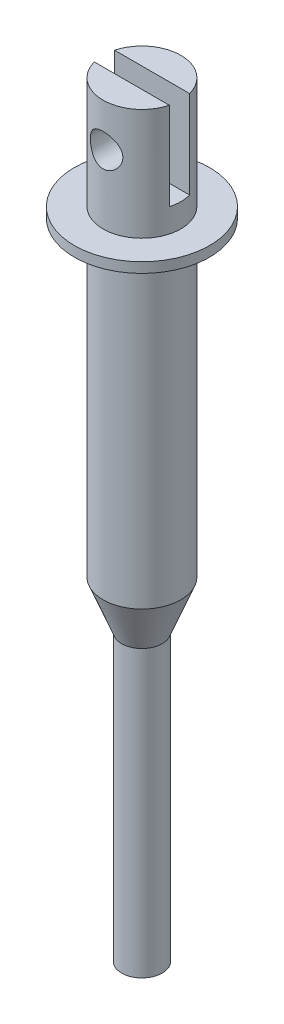
ISO-10303-21;
HEADER;
FILE_DESCRIPTION(('STEP AP214'),'2;1');
FILE_NAME('part.step','',(''),(''),'','','');
FILE_SCHEMA(('AUTOMOTIVE_DESIGN { 1 0 10303 214 1 1 1 1 }'));
ENDSEC;
DATA;
#1=APPLICATION_CONTEXT('core data for automotive mechanical design processes');
#2=APPLICATION_PROTOCOL_DEFINITION('international standard','automotive_design',2000,#1);
#3=PRODUCT_CONTEXT('',#1,'mechanical');
#4=PRODUCT('Part','Part','',(#3));
#5=PRODUCT_RELATED_PRODUCT_CATEGORY('part','',(#4));
#6=PRODUCT_DEFINITION_FORMATION('','',#4);
#7=PRODUCT_DEFINITION_CONTEXT('part definition',#1,'design');
#8=PRODUCT_DEFINITION('design','',#6,#7);
#9=PRODUCT_DEFINITION_SHAPE('','',#8);
#10=(LENGTH_UNIT() NAMED_UNIT(*) SI_UNIT(.MILLI.,.METRE.));
#11=(NAMED_UNIT(*) PLANE_ANGLE_UNIT() SI_UNIT($,.RADIAN.));
#12=(NAMED_UNIT(*) SI_UNIT($,.STERADIAN.) SOLID_ANGLE_UNIT());
#13=UNCERTAINTY_MEASURE_WITH_UNIT(LENGTH_MEASURE(1.E-05),#10,'distance_accuracy_value','');
#14=(GEOMETRIC_REPRESENTATION_CONTEXT(3) GLOBAL_UNCERTAINTY_ASSIGNED_CONTEXT((#13)) GLOBAL_UNIT_ASSIGNED_CONTEXT((#10,
#11,#12)) REPRESENTATION_CONTEXT('',''));
#15=CARTESIAN_POINT('',(0.,0.,0.));
#16=DIRECTION('',(0.,0.,1.));
#17=DIRECTION('',(1.,0.,0.));
#18=AXIS2_PLACEMENT_3D('',#15,#16,#17);
#19=CARTESIAN_POINT('',(0.,56.6,0.));
#20=DIRECTION('',(0.,1.,0.));
#21=DIRECTION('',(-1.,0.,0.));
#22=AXIS2_PLACEMENT_3D('',#19,#20,#21);
#23=CYLINDRICAL_SURFACE('',#22,2.875);
#24=CARTESIAN_POINT('',(0.,24.6,0.));
#25=DIRECTION('',(0.,1.,0.));
#26=DIRECTION('',(-1.,0.,0.));
#27=AXIS2_PLACEMENT_3D('',#24,#25,#26);
#28=CIRCLE('',#27,2.875);
#29=CARTESIAN_POINT('',(-2.875,24.6,0.));
#30=VERTEX_POINT('',#29);
#31=EDGE_CURVE('E107',#30,#30,#28,.T.);
#32=ORIENTED_EDGE('',*,*,#31,.T.);
#33=EDGE_LOOP('',(#32));
#34=FACE_BOUND('',#33,.T.);
#35=CARTESIAN_POINT('',(0.,47.6,0.));
#36=DIRECTION('',(0.,1.,0.));
#37=DIRECTION('',(-1.,0.,0.));
#38=AXIS2_PLACEMENT_3D('',#35,#36,#37);
#39=CIRCLE('',#38,2.875);
#40=CARTESIAN_POINT('',(-2.875,47.6,0.));
#41=VERTEX_POINT('',#40);
#42=EDGE_CURVE('E11',#41,#41,#39,.T.);
#43=ORIENTED_EDGE('',*,*,#42,.F.);
#44=EDGE_LOOP('',(#43));
#45=FACE_BOUND('',#44,.T.);
#46=ADVANCED_FACE('F44',(#34,#45),#23,.T.);
#47=CARTESIAN_POINT('',(0.,0.,0.));
#48=DIRECTION('',(0.,1.,0.));
#49=DIRECTION('',(-1.,0.,0.));
#50=AXIS2_PLACEMENT_3D('',#47,#48,#49);
#51=PLANE('',#50);
#52=CARTESIAN_POINT('',(0.,0.,0.));
#53=DIRECTION('',(0.,1.,0.));
#54=DIRECTION('',(-1.,0.,0.));
#55=AXIS2_PLACEMENT_3D('',#52,#53,#54);
#56=CIRCLE('',#55,1.50000000000001);
#57=CARTESIAN_POINT('',(-1.50000000000001,0.,0.));
#58=VERTEX_POINT('',#57);
#59=EDGE_CURVE('E125',#58,#58,#56,.T.);
#60=ORIENTED_EDGE('',*,*,#59,.F.);
#61=EDGE_LOOP('',(#60));
#62=FACE_BOUND('',#61,.T.);
#63=ADVANCED_FACE('F46',(#62),#51,.F.);
#64=CARTESIAN_POINT('',(0.,56.6,0.));
#65=DIRECTION('',(0.,1.,0.));
#66=DIRECTION('',(-1.,0.,0.));
#67=AXIS2_PLACEMENT_3D('',#64,#65,#66);
#68=CYLINDRICAL_SURFACE('',#67,1.50000000000001);
#69=CARTESIAN_POINT('',(0.,21.1,0.));
#70=DIRECTION('',(0.,1.,0.));
#71=DIRECTION('',(-1.,0.,0.));
#72=AXIS2_PLACEMENT_3D('',#69,#70,#71);
#73=CIRCLE('',#72,1.50000000000001);
#74=CARTESIAN_POINT('',(-1.50000000000001,21.1,0.));
#75=VERTEX_POINT('',#74);
#76=EDGE_CURVE('E115',#75,#75,#73,.T.);
#77=ORIENTED_EDGE('',*,*,#76,.F.);
#78=EDGE_LOOP('',(#77));
#79=FACE_BOUND('',#78,.T.);
#80=ORIENTED_EDGE('',*,*,#59,.T.);
#81=EDGE_LOOP('',(#80));
#82=FACE_BOUND('',#81,.T.);
#83=ADVANCED_FACE('F172',(#79,#82),#68,.T.);
#84=CARTESIAN_POINT('',(0.,21.1,0.));
#85=DIRECTION('',(0.,1.,0.));
#86=DIRECTION('',(-1.,0.,0.));
#87=AXIS2_PLACEMENT_3D('',#84,#85,#86);
#88=CONICAL_SURFACE('',#87,1.50000000000001,0.374333616007583);
#89=ORIENTED_EDGE('',*,*,#31,.F.);
#90=EDGE_LOOP('',(#89));
#91=FACE_BOUND('',#90,.T.);
#92=ORIENTED_EDGE('',*,*,#76,.T.);
#93=EDGE_LOOP('',(#92));
#94=FACE_BOUND('',#93,.T.);
#95=ADVANCED_FACE('F284',(#91,#94),#88,.T.);
#96=CARTESIAN_POINT('',(0.,48.35,0.));
#97=DIRECTION('',(0.,-1.,0.));
#98=DIRECTION('',(1.,0.,0.));
#99=AXIS2_PLACEMENT_3D('',#96,#97,#98);
#100=CYLINDRICAL_SURFACE('',#99,5.);
#101=CARTESIAN_POINT('',(0.,48.35,0.));
#102=DIRECTION('',(0.,1.,0.));
#103=DIRECTION('',(-1.,0.,0.));
#104=AXIS2_PLACEMENT_3D('',#101,#102,#103);
#105=CIRCLE('',#104,5.);
#106=CARTESIAN_POINT('',(-5.,48.35,0.));
#107=VERTEX_POINT('',#106);
#108=EDGE_CURVE('E183',#107,#107,#105,.T.);
#109=ORIENTED_EDGE('',*,*,#108,.F.);
#110=EDGE_LOOP('',(#109));
#111=FACE_BOUND('',#110,.T.);
#112=CARTESIAN_POINT('',(0.,47.6,0.));
#113=DIRECTION('',(0.,1.,0.));
#114=DIRECTION('',(-1.,0.,0.));
#115=AXIS2_PLACEMENT_3D('',#112,#113,#114);
#116=CIRCLE('',#115,5.);
#117=CARTESIAN_POINT('',(-5.,47.6,0.));
#118=VERTEX_POINT('',#117);
#119=EDGE_CURVE('E188',#118,#118,#116,.T.);
#120=ORIENTED_EDGE('',*,*,#119,.T.);
#121=EDGE_LOOP('',(#120));
#122=FACE_BOUND('',#121,.T.);
#123=ADVANCED_FACE('F280',(#111,#122),#100,.T.);
#124=CARTESIAN_POINT('',(0.,48.35,0.));
#125=DIRECTION('',(0.,1.,0.));
#126=DIRECTION('',(-1.,0.,0.));
#127=AXIS2_PLACEMENT_3D('',#124,#125,#126);
#128=PLANE('',#127);
#129=CARTESIAN_POINT('',(0.,48.35,0.));
#130=DIRECTION('',(0.,1.,0.));
#131=DIRECTION('',(-1.,0.,0.));
#132=AXIS2_PLACEMENT_3D('',#129,#130,#131);
#133=CIRCLE('',#132,2.875);
#134=CARTESIAN_POINT('',(-2.875,48.35,0.));
#135=VERTEX_POINT('',#134);
#136=EDGE_CURVE('E48',#135,#135,#133,.T.);
#137=ORIENTED_EDGE('',*,*,#136,.F.);
#138=EDGE_LOOP('',(#137));
#139=FACE_BOUND('',#138,.T.);
#140=ORIENTED_EDGE('',*,*,#108,.T.);
#141=EDGE_LOOP('',(#140));
#142=FACE_BOUND('',#141,.T.);
#143=ADVANCED_FACE('F283',(#139,#142),#128,.T.);
#144=CARTESIAN_POINT('',(0.,47.6,0.));
#145=DIRECTION('',(0.,1.,0.));
#146=DIRECTION('',(-1.,0.,0.));
#147=AXIS2_PLACEMENT_3D('',#144,#145,#146);
#148=PLANE('',#147);
#149=ORIENTED_EDGE('',*,*,#42,.T.);
#150=EDGE_LOOP('',(#149));
#151=FACE_BOUND('',#150,.T.);
#152=ORIENTED_EDGE('',*,*,#119,.F.);
#153=EDGE_LOOP('',(#152));
#154=FACE_BOUND('',#153,.T.);
#155=ADVANCED_FACE('F151',(#151,#154),#148,.F.);
#156=CARTESIAN_POINT('',(0.,53.4,-2.875));
#157=DIRECTION('',(0.,0.,1.));
#158=DIRECTION('',(1.,0.,0.));
#159=AXIS2_PLACEMENT_3D('',#156,#157,#158);
#160=CYLINDRICAL_SURFACE('',#159,1.2);
#161=CARTESIAN_POINT('',(0.,53.4,0.75));
#162=DIRECTION('',(0.,0.,1.));
#163=DIRECTION('',(1.,0.,0.));
#164=AXIS2_PLACEMENT_3D('',#161,#162,#163);
#165=CIRCLE('',#164,1.2);
#166=CARTESIAN_POINT('',(1.2,53.4,0.75));
#167=VERTEX_POINT('',#166);
#168=EDGE_CURVE('E204',#167,#167,#165,.F.);
#169=ORIENTED_EDGE('',*,*,#168,.T.);
#170=EDGE_LOOP('',(#169));
#171=FACE_BOUND('',#170,.T.);
#172=CARTESIAN_POINT('',(1.2,53.4,2.61258971137835));
#173=CARTESIAN_POINT('',(1.19999284556273,53.3360063842677,2.61259664140036));
#174=CARTESIAN_POINT('',(1.19484858976294,53.2719087327679,2.61497523266794));
#175=CARTESIAN_POINT('',(1.1744704973721,53.1455639299689,2.62418758364091));
#176=CARTESIAN_POINT('',(1.15920930563969,53.0833222752231,2.6310334215288));
#177=CARTESIAN_POINT('',(1.11929601028592,52.9627456288845,2.64825758800242));
#178=CARTESIAN_POINT('',(1.09468227852068,52.9043958046387,2.65862146439826));
#179=CARTESIAN_POINT('',(1.03687520776025,52.7926705251039,2.68169338490034));
#180=CARTESIAN_POINT('',(1.00368387749264,52.7392939091506,2.69440087997175));
#181=CARTESIAN_POINT('',(0.927447774108694,52.6356646893032,2.72161565839842));
#182=CARTESIAN_POINT('',(0.883951439116221,52.5857601815999,2.73618411164575));
#183=CARTESIAN_POINT('',(0.789288182927321,52.493696541244,2.76497659915055));
#184=CARTESIAN_POINT('',(0.738118312042364,52.4515404009749,2.77920049850946));
#185=CARTESIAN_POINT('',(0.626824192142549,52.3743927247425,2.80644516352552));
#186=CARTESIAN_POINT('',(0.56640702115442,52.3397931793169,2.81938655143998));
#187=CARTESIAN_POINT('',(0.439971996401211,52.2813995143558,2.84185900778628));
#188=CARTESIAN_POINT('',(0.373956652633748,52.2576005823396,2.85139159469154));
#189=CARTESIAN_POINT('',(0.241854227766699,52.2227463459582,2.86553849488684));
#190=CARTESIAN_POINT('',(0.175950763836402,52.21109068543,2.87038356234547));
#191=CARTESIAN_POINT('',(0.0429573143125445,52.1989136541522,2.87544790566677));
#192=CARTESIAN_POINT('',(-0.024132177093845,52.1983877504841,2.87566906475079));
#193=CARTESIAN_POINT('',(-0.153226834231555,52.2081712297781,2.87159632181655));
#194=CARTESIAN_POINT('',(-0.215292295883481,52.2178208958016,2.86757731615899));
#195=CARTESIAN_POINT('',(-0.336829155461755,52.2465503016811,2.85585363944535));
#196=CARTESIAN_POINT('',(-0.396300361768366,52.2656307368437,2.84814869663584));
#197=CARTESIAN_POINT('',(-0.512052092155438,52.3129065084115,2.82964988292411));
#198=CARTESIAN_POINT('',(-0.568270068777885,52.3412365098751,2.81881066423381));
#199=CARTESIAN_POINT('',(-0.675301378303749,52.4060749949218,2.79510330548184));
#200=CARTESIAN_POINT('',(-0.726112789574458,52.4425863721511,2.78223444804145));
#201=CARTESIAN_POINT('',(-0.824705876688111,52.5257529634537,2.75468471207565));
#202=CARTESIAN_POINT('',(-0.87201937498326,52.5729428425615,2.73994004851096));
#203=CARTESIAN_POINT('',(-0.958263792466822,52.6746192268054,2.71098313312504));
#204=CARTESIAN_POINT('',(-0.99719145438691,52.7291085539491,2.69677108995104));
#205=CARTESIAN_POINT('',(-1.06676692248664,52.8461136984182,2.67003220002571));
#206=CARTESIAN_POINT('',(-1.09709825636768,52.9088353956019,2.65757664597254));
#207=CARTESIAN_POINT('',(-1.14657693911118,53.03915425907,2.63661088561045));
#208=CARTESIAN_POINT('',(-1.16573231727387,53.1067478858202,2.62809784773286));
#209=CARTESIAN_POINT('',(-1.19112252033481,53.2402001414986,2.61668393132893));
#210=CARTESIAN_POINT('',(-1.19811668182481,53.3058856699208,2.6134540433806));
#211=CARTESIAN_POINT('',(-1.20121682547205,53.4375570735708,2.6120314574288));
#212=CARTESIAN_POINT('',(-1.197326596406,53.5035428363059,2.61383700662579));
#213=CARTESIAN_POINT('',(-1.17946141197837,53.6294676105247,2.62194183799779));
#214=CARTESIAN_POINT('',(-1.1661514547335,53.6895225031113,2.62794450001455));
#215=CARTESIAN_POINT('',(-1.1307066527664,53.8064967746091,2.64338766907825));
#216=CARTESIAN_POINT('',(-1.10856974053102,53.8634154153673,2.65282898150583));
#217=CARTESIAN_POINT('',(-1.05505780609811,53.9752002853966,2.67457347812789));
#218=CARTESIAN_POINT('',(-1.02333072031862,54.0298770125232,2.6869810785552));
#219=CARTESIAN_POINT('',(-0.951888914716149,54.1333938322438,2.7131121976691));
#220=CARTESIAN_POINT('',(-0.9121707292119,54.1822313777259,2.72683628595091));
#221=CARTESIAN_POINT('',(-0.822047356686276,54.2768387420158,2.75540784963529));
#222=CARTESIAN_POINT('',(-0.771033960416184,54.3220314267248,2.77025544673861));
#223=CARTESIAN_POINT('',(-0.661804109583874,54.4033192075952,2.79835973701495));
#224=CARTESIAN_POINT('',(-0.603587116520102,54.4394136230063,2.8116163111057));
#225=CARTESIAN_POINT('',(-0.481181519150637,54.501445322625,2.83513293140083));
#226=CARTESIAN_POINT('',(-0.416977247408784,54.5273549771092,2.84538480742831));
#227=CARTESIAN_POINT('',(-0.284583345105468,54.5678166380713,2.86165582229945));
#228=CARTESIAN_POINT('',(-0.216396121833665,54.5823754301837,2.86767748978151));
#229=CARTESIAN_POINT('',(-0.0831297585472931,54.5988653584502,2.87451783188243));
#230=CARTESIAN_POINT('',(-0.0181678182559825,54.6016101572468,2.87567164824115));
#231=CARTESIAN_POINT('',(0.111268134308395,54.5965833987115,2.87357459210295));
#232=CARTESIAN_POINT('',(0.175742230627629,54.5888136963134,2.87032449652962));
#233=CARTESIAN_POINT('',(0.299999994009444,54.56356263346,2.85996118715932));
#234=CARTESIAN_POINT('',(0.359868936928414,54.5464377788464,2.85298998790774));
#235=CARTESIAN_POINT('',(0.475860921809012,54.5033523456,2.8359515309254));
#236=CARTESIAN_POINT('',(0.531983251066755,54.4773900915591,2.82588368616258));
#237=CARTESIAN_POINT('',(0.641685358056028,54.4160543897767,2.80306011332294));
#238=CARTESIAN_POINT('',(0.695035352481653,54.3803084127209,2.79020341530483));
#239=CARTESIAN_POINT('',(0.795207511053898,54.3009614270475,2.76332485161005));
#240=CARTESIAN_POINT('',(0.842027230026578,54.2573574900547,2.74930255260948));
#241=CARTESIAN_POINT('',(0.931136804507447,54.1600194602667,2.72046883469035));
#242=CARTESIAN_POINT('',(0.972898597584325,54.1057967846109,2.70566895857699));
#243=CARTESIAN_POINT('',(1.04680854725829,53.990653386878,2.67794349687549));
#244=CARTESIAN_POINT('',(1.07895131830978,53.9297289385858,2.66501896334157));
#245=CARTESIAN_POINT('',(1.13236916052694,53.8030421214063,2.64276416292639));
#246=CARTESIAN_POINT('',(1.15369986094035,53.7373065500123,2.63341555982185));
#247=CARTESIAN_POINT('',(1.18473965962268,53.6027867622469,2.619602669705));
#248=CARTESIAN_POINT('',(1.19448773857349,53.5340135840481,2.61512200429952));
#249=CARTESIAN_POINT('',(1.19941551372524,53.4433379417888,2.61285709596707));
#250=CARTESIAN_POINT('',(1.20000242324153,53.4216749384315,2.61258736414732));
#251=CARTESIAN_POINT('',(1.2,53.4,2.61258971137835));
#252=B_SPLINE_CURVE_WITH_KNOTS('',3,(#172,#173,#174,#175,#176,#177,#178,#179,#180,#181,#182,
#183,#184,#185,#186,#187,#188,#189,#190,#191,#192,#193,#194,#195,#196,#197,#198,#199,#200,#201,
#202,#203,#204,#205,#206,#207,#208,#209,#210,#211,#212,#213,#214,#215,#216,#217,#218,#219,#220,
#221,#222,#223,#224,#225,#226,#227,#228,#229,#230,#231,#232,#233,#234,#235,#236,#237,#238,#239,
#240,#241,#242,#243,#244,#245,#246,#247,#248,#249,#250,#251),.UNSPECIFIED.,.T.,.F.,(4,2,2,2,2,2,
2,2,2,2,2,2,2,2,2,2,2,2,2,2,2,2,2,2,2,2,2,2,2,2,2,2,2,2,2,2,2,2,2,4),(0.,0.191918579757424,
0.384358215578368,0.576016684121689,0.767630310122134,0.970095159555179,1.1726380364294,
1.38400200285017,1.59527169813264,1.7955133813559,1.99567350873217,2.18361046358322,
2.37156127661591,2.56238054684033,2.75326741418508,2.95764988815247,3.16211160680424,
3.37333647948665,3.58440941142493,3.78175385792235,3.97902961880925,4.16361186152578,
4.34823736384848,4.54069511560212,4.73323651549177,4.94151753155633,5.14981412698926,
5.35867196302944,5.56740484627838,5.76150543591806,5.95557178743124,6.142711912663,
6.32988753599414,6.52552840728342,6.72124233813216,6.93032825768786,7.13953102322331,
7.34764620550038,7.5550589855349,7.62006271055499),.UNSPECIFIED.);
#253=CARTESIAN_POINT('',(1.2,53.4,2.61258971137835));
#254=VERTEX_POINT('',#253);
#255=EDGE_CURVE('E129',#254,#254,#252,.T.);
#256=ORIENTED_EDGE('',*,*,#255,.F.);
#257=EDGE_LOOP('',(#256));
#258=FACE_BOUND('',#257,.T.);
#259=ADVANCED_FACE('F146',(#171,#258),#160,.F.);
#260=CARTESIAN_POINT('',(0.,53.4,-0.75));
#261=DIRECTION('',(0.,0.,-1.));
#262=DIRECTION('',(-1.,0.,0.));
#263=AXIS2_PLACEMENT_3D('',#260,#261,#262);
#264=CIRCLE('',#263,1.2);
#265=CARTESIAN_POINT('',(-1.2,53.4,-0.749999999999999));
#266=VERTEX_POINT('',#265);
#267=EDGE_CURVE('E103',#266,#266,#264,.F.);
#268=ORIENTED_EDGE('',*,*,#267,.T.);
#269=EDGE_LOOP('',(#268));
#270=FACE_BOUND('',#269,.T.);
#271=CARTESIAN_POINT('',(0.,54.6,-2.875));
#272=CARTESIAN_POINT('',(-0.0642702003449837,54.5999930486833,-2.87499477092273));
#273=CARTESIAN_POINT('',(-0.128640977369331,54.5948060733855,-2.87281991288097));
#274=CARTESIAN_POINT('',(-0.255557692306066,54.5742425694996,-2.86433020707326));
#275=CARTESIAN_POINT('',(-0.318098433282713,54.5588395021803,-2.85800457714638));
#276=CARTESIAN_POINT('',(-0.4393108796073,54.5185122918236,-2.84189289412547));
#277=CARTESIAN_POINT('',(-0.497994926858027,54.4936204474956,-2.83211858823766));
#278=CARTESIAN_POINT('',(-0.61029729455332,54.4351558089209,-2.81006080886084));
#279=CARTESIAN_POINT('',(-0.663917132993702,54.4015856273522,-2.79777809078133));
#280=CARTESIAN_POINT('',(-0.767354059969789,54.3249322494784,-2.77124054984708));
#281=CARTESIAN_POINT('',(-0.816882728036641,54.2814824637055,-2.75692099708886));
#282=CARTESIAN_POINT('',(-0.908198300251296,54.1870784278661,-2.72820392861484));
#283=CARTESIAN_POINT('',(-0.949981115047008,54.1361202391416,-2.71380637582431));
#284=CARTESIAN_POINT('',(-1.02665922400105,54.0250936753486,-2.68576741561524));
#285=CARTESIAN_POINT('',(-1.06111215716524,53.9646995570416,-2.67219852712514));
#286=CARTESIAN_POINT('',(-1.11924147276094,53.8383248966416,-2.64838020475281));
#287=CARTESIAN_POINT('',(-1.14292342590447,53.7723472633133,-2.63812905574075));
#288=CARTESIAN_POINT('',(-1.17764647570023,53.6399981744278,-2.62280772401278));
#289=CARTESIAN_POINT('',(-1.1892427693492,53.5737995878203,-2.61751125954026));
#290=CARTESIAN_POINT('',(-1.20119733851004,53.440200638478,-2.61204857715627));
#291=CARTESIAN_POINT('',(-1.2015618426911,53.3728009625676,-2.61187951580754));
#292=CARTESIAN_POINT('',(-1.19146056016093,53.2442521205738,-2.61649930278983));
#293=CARTESIAN_POINT('',(-1.18182629600421,53.1830211826379,-2.62090750828224));
#294=CARTESIAN_POINT('',(-1.15339609374654,53.0631409430646,-2.63354169214506));
#295=CARTESIAN_POINT('',(-1.1345983939025,53.004492140228,-2.64176840463911));
#296=CARTESIAN_POINT('',(-1.08800820174634,52.8899573596158,-2.66129863494795));
#297=CARTESIAN_POINT('',(-1.06003252930545,52.8341569150549,-2.67266399605831));
#298=CARTESIAN_POINT('',(-0.996010083183636,52.7278250001926,-2.697176669546));
#299=CARTESIAN_POINT('',(-0.959960120320865,52.6772956234474,-2.71032468522386));
#300=CARTESIAN_POINT('',(-0.877222357676711,52.5784285435401,-2.73827812260127));
#301=CARTESIAN_POINT('',(-0.829891553278451,52.5306404166457,-2.75312952507089));
#302=CARTESIAN_POINT('',(-0.727740908499753,52.4434950992422,-2.78187554387864));
#303=CARTESIAN_POINT('',(-0.67291930665602,52.4041398973447,-2.79576993401573));
#304=CARTESIAN_POINT('',(-0.555668201541569,52.3341678256903,-2.82144239789839));
#305=CARTESIAN_POINT('',(-0.493091524597958,52.3037752383366,-2.83316379773823));
#306=CARTESIAN_POINT('',(-0.363099321817605,52.2541415246333,-2.85273430612153));
#307=CARTESIAN_POINT('',(-0.295686503158657,52.2348942132811,-2.86058556201721));
#308=CARTESIAN_POINT('',(-0.16252771846287,52.2092494055985,-2.87112958903152));
#309=CARTESIAN_POINT('',(-0.0969471628377675,52.2021144167418,-2.87411792146848));
#310=CARTESIAN_POINT('',(0.0345369314602115,52.1986971861561,-2.8755433699118));
#311=CARTESIAN_POINT('',(0.100440371520445,52.2024118147967,-2.87398179836271));
#312=CARTESIAN_POINT('',(0.227240980488559,52.2200610555416,-2.86667450234434));
#313=CARTESIAN_POINT('',(0.288223960350126,52.2334771051133,-2.86114118328918));
#314=CARTESIAN_POINT('',(0.40700659000241,52.2694259264734,-2.84667402770605));
#315=CARTESIAN_POINT('',(0.464805836918866,52.2919598490535,-2.83773976194369));
#316=CARTESIAN_POINT('',(0.577608109501823,52.3462406892717,-2.81698184044285));
#317=CARTESIAN_POINT('',(0.632468408181814,52.378252165477,-2.80507701693894));
#318=CARTESIAN_POINT('',(0.736235088510371,52.4502887958776,-2.77964775175525));
#319=CARTESIAN_POINT('',(0.785138966763177,52.4903173009504,-2.76612263379413));
#320=CARTESIAN_POINT('',(0.879290575794093,52.5806093770587,-2.73771112128587));
#321=CARTESIAN_POINT('',(0.924024711447991,52.6314010369883,-2.72279665651335));
#322=CARTESIAN_POINT('',(1.00447862920669,52.7400070459875,-2.6941558879981));
#323=CARTESIAN_POINT('',(1.04019633761106,52.7978230060647,-2.68042985806116));
#324=CARTESIAN_POINT('',(1.10199658785333,52.9200446814538,-2.65562766094133));
#325=CARTESIAN_POINT('',(1.12793235839763,52.9845335858891,-2.64459267463453));
#326=CARTESIAN_POINT('',(1.16835570400422,53.117568750544,-2.62698783968053));
#327=CARTESIAN_POINT('',(1.18285276323255,53.1861115987205,-2.62041429255902));
#328=CARTESIAN_POINT('',(1.19904309037306,53.3196080169726,-2.61304277010225));
#329=CARTESIAN_POINT('',(1.2016383101574,53.3844302415361,-2.61183814327171));
#330=CARTESIAN_POINT('',(1.1963608931999,53.513548436148,-2.61425981032622));
#331=CARTESIAN_POINT('',(1.18848987693725,53.5778444861129,-2.61788535635952));
#332=CARTESIAN_POINT('',(1.16326193480183,53.7009791549552,-2.62918663431725));
#333=CARTESIAN_POINT('',(1.14636697298515,53.7599323144475,-2.63666454004906));
#334=CARTESIAN_POINT('',(1.1040232416624,53.8741803177453,-2.65467214185165));
#335=CARTESIAN_POINT('',(1.07857206687726,53.9294741276158,-2.66520269595266));
#336=CARTESIAN_POINT('',(1.01807281602881,54.0384700483177,-2.68891566696478));
#337=CARTESIAN_POINT('',(0.982538945784696,54.0918755769216,-2.70221962573669));
#338=CARTESIAN_POINT('',(0.903562011643928,54.1922481309535,-2.72964222608782));
#339=CARTESIAN_POINT('',(0.860116189979124,54.2392129013709,-2.74376115055351));
#340=CARTESIAN_POINT('',(0.762773472372846,54.3289077735259,-2.77246413657747));
#341=CARTESIAN_POINT('',(0.708344375029893,54.3710763144454,-2.78700660302));
#342=CARTESIAN_POINT('',(0.592643829576797,54.4457106571806,-2.81387990606783));
#343=CARTESIAN_POINT('',(0.531369282548203,54.4781720399412,-2.82620973438066));
#344=CARTESIAN_POINT('',(0.404659843750437,54.5317715546333,-2.84709182223336));
#345=CARTESIAN_POINT('',(0.339309799402698,54.5530868853829,-2.85570279274394));
#346=CARTESIAN_POINT('',(0.205635043426525,54.5842268005141,-2.8684159439926));
#347=CARTESIAN_POINT('',(0.137320341603181,54.5940873396226,-2.87253223035672));
#348=CARTESIAN_POINT('',(0.0458437162821006,54.5993457029719,-2.87472760429391));
#349=CARTESIAN_POINT('',(0.0229282582905801,54.6000024798676,-2.87500186546228));
#350=CARTESIAN_POINT('',(0.,54.6,-2.875));
#351=B_SPLINE_CURVE_WITH_KNOTS('',3,(#271,#272,#273,#274,#275,#276,#277,#278,#279,#280,#281,
#282,#283,#284,#285,#286,#287,#288,#289,#290,#291,#292,#293,#294,#295,#296,#297,#298,#299,#300,
#301,#302,#303,#304,#305,#306,#307,#308,#309,#310,#311,#312,#313,#314,#315,#316,#317,#318,#319,
#320,#321,#322,#323,#324,#325,#326,#327,#328,#329,#330,#331,#332,#333,#334,#335,#336,#337,#338,
#339,#340,#341,#342,#343,#344,#345,#346,#347,#348,#349,#350),.UNSPECIFIED.,.T.,.F.,(4,2,2,2,2,2,
2,2,2,2,2,2,2,2,2,2,2,2,2,2,2,2,2,2,2,2,2,2,2,2,2,2,2,2,2,2,2,2,2,4),(0.,0.192745173714279,
0.385993020323866,0.578588863689107,0.771126792029185,0.972522223128261,1.1740236781705,
1.38548209204226,1.59683101567158,1.79797401094674,1.99900545892639,2.18456212579871,
2.37015448148789,2.55970265831827,2.74932583529926,2.95503546313977,3.16079354717696,
3.37133243492055,3.58175437314583,3.77883192215896,3.9758526287096,4.16305435672899,
4.35027971936616,4.5433237033971,4.73644854303774,4.94342115576836,5.15044132713221,
5.36045459319081,5.57029354766891,5.76393493410952,5.95754634269556,6.14208188832788,
6.32666935309296,6.5223773712149,6.7181537358081,6.92825977712269,7.13846132132846,
7.34521088154442,7.55130971993664,7.62007115374985),.UNSPECIFIED.);
#352=CARTESIAN_POINT('',(0.,54.6,-2.875));
#353=VERTEX_POINT('',#352);
#354=EDGE_CURVE('E138',#353,#353,#351,.T.);
#355=ORIENTED_EDGE('',*,*,#354,.F.);
#356=EDGE_LOOP('',(#355));
#357=FACE_BOUND('',#356,.T.);
#358=ADVANCED_FACE('F150',(#270,#357),#160,.F.);
#359=CARTESIAN_POINT('',(2.875,56.6,0.));
#360=DIRECTION('',(0.,-1.,0.));
#361=DIRECTION('',(1.,0.,0.));
#362=AXIS2_PLACEMENT_3D('',#359,#360,#361);
#363=PLANE('',#362);
#364=CARTESIAN_POINT('',(0.,56.6,0.));
#365=DIRECTION('',(0.,1.,0.));
#366=DIRECTION('',(-1.,0.,0.));
#367=AXIS2_PLACEMENT_3D('',#364,#365,#366);
#368=CIRCLE('',#367,2.875);
#369=CARTESIAN_POINT('',(-2.77545041389682,56.6,0.75));
#370=VERTEX_POINT('',#369);
#371=CARTESIAN_POINT('',(2.77545041389682,56.6,0.75));
#372=VERTEX_POINT('',#371);
#373=EDGE_CURVE('E100',#370,#372,#368,.T.);
#374=ORIENTED_EDGE('',*,*,#373,.T.);
#375=DIRECTION('',(1.,0.,0.));
#376=VECTOR('',#375,1.);
#377=CARTESIAN_POINT('',(-2.875,56.6,0.75));
#378=LINE('',#377,#376);
#379=EDGE_CURVE('E86',#370,#372,#378,.T.);
#380=ORIENTED_EDGE('',*,*,#379,.F.);
#381=EDGE_LOOP('',(#374,#380));
#382=FACE_BOUND('',#381,.T.);
#383=ADVANCED_FACE('F105',(#382),#363,.F.);
#384=CARTESIAN_POINT('',(-2.875,50.1,0.75));
#385=DIRECTION('',(0.,0.,1.));
#386=DIRECTION('',(1.,0.,0.));
#387=AXIS2_PLACEMENT_3D('',#384,#385,#386);
#388=PLANE('',#387);
#389=ORIENTED_EDGE('',*,*,#168,.F.);
#390=EDGE_LOOP('',(#389));
#391=FACE_BOUND('',#390,.T.);
#392=DIRECTION('',(1.,0.,0.));
#393=VECTOR('',#392,1.);
#394=CARTESIAN_POINT('',(-2.875,50.1,0.75));
#395=LINE('',#394,#393);
#396=CARTESIAN_POINT('',(-2.77545041389682,50.1,0.749999999999999));
#397=VERTEX_POINT('',#396);
#398=CARTESIAN_POINT('',(2.77545041389682,50.1,0.749999999999999));
#399=VERTEX_POINT('',#398);
#400=EDGE_CURVE('E198',#397,#399,#395,.T.);
#401=ORIENTED_EDGE('',*,*,#400,.F.);
#402=DIRECTION('',(0.,1.,0.));
#403=VECTOR('',#402,1.);
#404=CARTESIAN_POINT('',(-2.77545041389682,56.6,0.75));
#405=LINE('',#404,#403);
#406=EDGE_CURVE('E61',#370,#397,#405,.F.);
#407=ORIENTED_EDGE('',*,*,#406,.F.);
#408=ORIENTED_EDGE('',*,*,#379,.T.);
#409=DIRECTION('',(0.,1.,0.));
#410=VECTOR('',#409,1.);
#411=CARTESIAN_POINT('',(2.77545041389682,56.6,0.75));
#412=LINE('',#411,#410);
#413=EDGE_CURVE('E89',#399,#372,#412,.T.);
#414=ORIENTED_EDGE('',*,*,#413,.F.);
#415=EDGE_LOOP('',(#401,#407,#408,#414));
#416=FACE_BOUND('',#415,.T.);
#417=ADVANCED_FACE('F88',(#391,#416),#388,.F.);
#418=CARTESIAN_POINT('',(0.,50.1,0.));
#419=DIRECTION('',(0.,1.,0.));
#420=DIRECTION('',(0.,0.,1.));
#421=AXIS2_PLACEMENT_3D('',#418,#419,#420);
#422=PLANE('',#421);
#423=ORIENTED_EDGE('',*,*,#400,.T.);
#424=CARTESIAN_POINT('',(0.,50.1,0.));
#425=DIRECTION('',(0.,1.,0.));
#426=DIRECTION('',(0.,0.,1.));
#427=AXIS2_PLACEMENT_3D('',#424,#425,#426);
#428=CIRCLE('',#427,2.875);
#429=CARTESIAN_POINT('',(2.77545041389682,50.1,-0.75));
#430=VERTEX_POINT('',#429);
#431=EDGE_CURVE('E54',#399,#430,#428,.T.);
#432=ORIENTED_EDGE('',*,*,#431,.T.);
#433=DIRECTION('',(-1.,0.,0.));
#434=VECTOR('',#433,1.);
#435=CARTESIAN_POINT('',(-2.875,50.1,-0.749999999999999));
#436=LINE('',#435,#434);
#437=CARTESIAN_POINT('',(-2.77545041389682,50.1,-0.749999999999999));
#438=VERTEX_POINT('',#437);
#439=EDGE_CURVE('E201',#430,#438,#436,.T.);
#440=ORIENTED_EDGE('',*,*,#439,.T.);
#441=EDGE_CURVE('E68',#438,#397,#428,.T.);
#442=ORIENTED_EDGE('',*,*,#441,.T.);
#443=EDGE_LOOP('',(#423,#432,#440,#442));
#444=FACE_BOUND('',#443,.T.);
#445=ADVANCED_FACE('F161',(#444),#422,.T.);
#446=CARTESIAN_POINT('',(-2.875,50.1,-0.749999999999999));
#447=DIRECTION('',(0.,0.,-1.));
#448=DIRECTION('',(-1.,0.,0.));
#449=AXIS2_PLACEMENT_3D('',#446,#447,#448);
#450=PLANE('',#449);
#451=ORIENTED_EDGE('',*,*,#267,.F.);
#452=EDGE_LOOP('',(#451));
#453=FACE_BOUND('',#452,.T.);
#454=ORIENTED_EDGE('',*,*,#439,.F.);
#455=DIRECTION('',(0.,1.,0.));
#456=VECTOR('',#455,1.);
#457=CARTESIAN_POINT('',(2.77545041389682,56.6,-0.75));
#458=LINE('',#457,#456);
#459=CARTESIAN_POINT('',(2.77545041389682,56.6,-0.75));
#460=VERTEX_POINT('',#459);
#461=EDGE_CURVE('E209',#460,#430,#458,.F.);
#462=ORIENTED_EDGE('',*,*,#461,.F.);
#463=DIRECTION('',(-1.,0.,0.));
#464=VECTOR('',#463,1.);
#465=CARTESIAN_POINT('',(-2.875,56.6,-0.749999999999999));
#466=LINE('',#465,#464);
#467=CARTESIAN_POINT('',(-2.77545041389682,56.6,-0.749999999999999));
#468=VERTEX_POINT('',#467);
#469=EDGE_CURVE('E95',#460,#468,#466,.T.);
#470=ORIENTED_EDGE('',*,*,#469,.T.);
#471=DIRECTION('',(0.,1.,0.));
#472=VECTOR('',#471,1.);
#473=CARTESIAN_POINT('',(-2.77545041389682,56.6,-0.749999999999999));
#474=LINE('',#473,#472);
#475=EDGE_CURVE('E118',#438,#468,#474,.T.);
#476=ORIENTED_EDGE('',*,*,#475,.F.);
#477=EDGE_LOOP('',(#454,#462,#470,#476));
#478=FACE_BOUND('',#477,.T.);
#479=ADVANCED_FACE('F165',(#453,#478),#450,.F.);
#480=EDGE_CURVE('E108',#460,#468,#368,.T.);
#481=ORIENTED_EDGE('',*,*,#480,.T.);
#482=ORIENTED_EDGE('',*,*,#469,.F.);
#483=EDGE_LOOP('',(#481,#482));
#484=FACE_BOUND('',#483,.T.);
#485=ADVANCED_FACE('F156',(#484),#363,.F.);
#486=ORIENTED_EDGE('',*,*,#136,.T.);
#487=EDGE_LOOP('',(#486));
#488=FACE_BOUND('',#487,.T.);
#489=ORIENTED_EDGE('',*,*,#480,.F.);
#490=ORIENTED_EDGE('',*,*,#461,.T.);
#491=ORIENTED_EDGE('',*,*,#431,.F.);
#492=ORIENTED_EDGE('',*,*,#413,.T.);
#493=ORIENTED_EDGE('',*,*,#373,.F.);
#494=ORIENTED_EDGE('',*,*,#406,.T.);
#495=ORIENTED_EDGE('',*,*,#441,.F.);
#496=ORIENTED_EDGE('',*,*,#475,.T.);
#497=EDGE_LOOP('',(#489,#490,#491,#492,#493,#494,#495,#496));
#498=FACE_BOUND('',#497,.T.);
#499=ORIENTED_EDGE('',*,*,#354,.T.);
#500=EDGE_LOOP('',(#499));
#501=FACE_BOUND('',#500,.T.);
#502=ORIENTED_EDGE('',*,*,#255,.T.);
#503=EDGE_LOOP('',(#502));
#504=FACE_BOUND('',#503,.T.);
#505=ADVANCED_FACE('F98',(#488,#498,#501,#504),#23,.T.);
#506=CLOSED_SHELL('',(#46,#63,#83,#95,#123,#143,#155,#259,#358,#383,#417,#445,#479,#485,#505));
#507=MANIFOLD_SOLID_BREP('B2',#506);
#508=ADVANCED_BREP_SHAPE_REPRESENTATION('',(#18,#507),#14);
#509=SHAPE_DEFINITION_REPRESENTATION(#9,#508);
ENDSEC;
END-ISO-10303-21;
